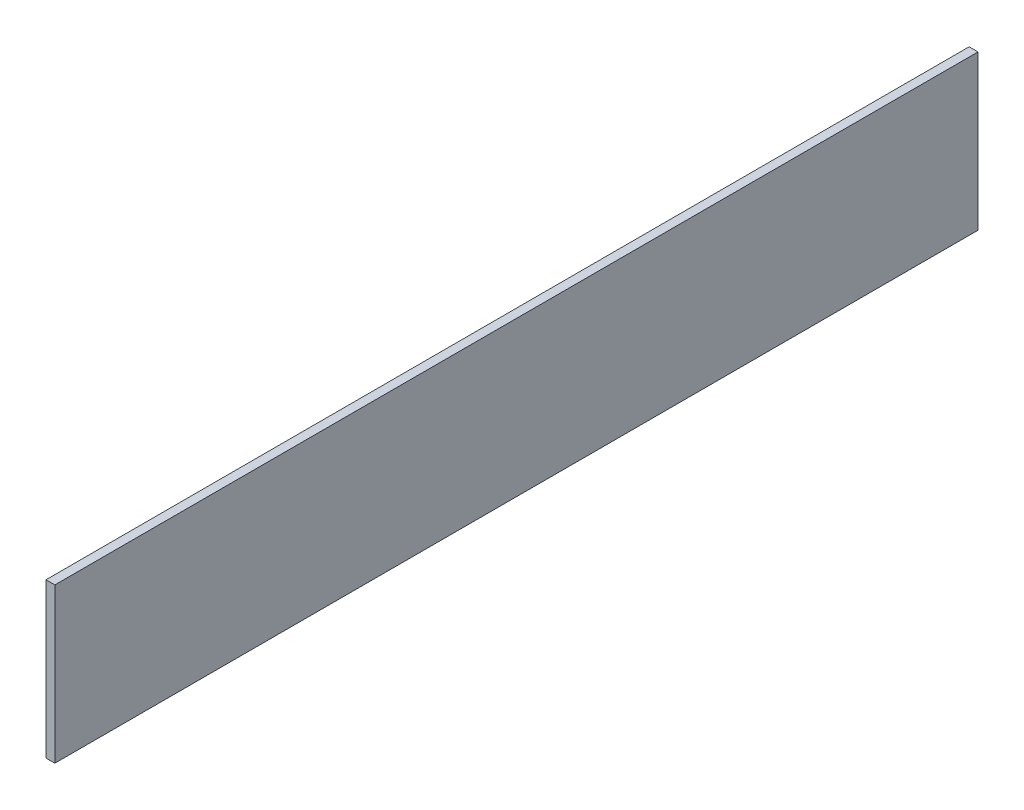
ISO-10303-21;
HEADER;
FILE_DESCRIPTION(('STEP AP214'),'2;1');
FILE_NAME('part.step','',(''),(''),'','','');
FILE_SCHEMA(('AUTOMOTIVE_DESIGN { 1 0 10303 214 1 1 1 1 }'));
ENDSEC;
DATA;
#1=APPLICATION_CONTEXT('core data for automotive mechanical design processes');
#2=APPLICATION_PROTOCOL_DEFINITION('international standard','automotive_design',2000,#1);
#3=PRODUCT_CONTEXT('',#1,'mechanical');
#4=PRODUCT('Part','Part','',(#3));
#5=PRODUCT_RELATED_PRODUCT_CATEGORY('part','',(#4));
#6=PRODUCT_DEFINITION_FORMATION('','',#4);
#7=PRODUCT_DEFINITION_CONTEXT('part definition',#1,'design');
#8=PRODUCT_DEFINITION('design','',#6,#7);
#9=PRODUCT_DEFINITION_SHAPE('','',#8);
#10=(LENGTH_UNIT() NAMED_UNIT(*) SI_UNIT(.MILLI.,.METRE.));
#11=(NAMED_UNIT(*) PLANE_ANGLE_UNIT() SI_UNIT($,.RADIAN.));
#12=(NAMED_UNIT(*) SI_UNIT($,.STERADIAN.) SOLID_ANGLE_UNIT());
#13=UNCERTAINTY_MEASURE_WITH_UNIT(LENGTH_MEASURE(1.E-05),#10,'distance_accuracy_value','');
#14=(GEOMETRIC_REPRESENTATION_CONTEXT(3) GLOBAL_UNCERTAINTY_ASSIGNED_CONTEXT((#13)) GLOBAL_UNIT_ASSIGNED_CONTEXT((#10,
#11,#12)) REPRESENTATION_CONTEXT('',''));
#15=CARTESIAN_POINT('',(0.,0.,0.));
#16=DIRECTION('',(0.,0.,1.));
#17=DIRECTION('',(1.,0.,0.));
#18=AXIS2_PLACEMENT_3D('',#15,#16,#17);
#19=CARTESIAN_POINT('',(2.5,0.,99.9999999999999));
#20=DIRECTION('',(0.,-1.,0.));
#21=DIRECTION('',(0.,0.,-1.));
#22=AXIS2_PLACEMENT_3D('',#19,#20,#21);
#23=PLANE('',#22);
#24=DIRECTION('',(-1.,0.,0.));
#25=VECTOR('',#24,1.);
#26=CARTESIAN_POINT('',(2.5,0.,99.9999999999999));
#27=LINE('',#26,#25);
#28=CARTESIAN_POINT('',(0.,0.,99.9999999999999));
#29=VERTEX_POINT('',#28);
#30=CARTESIAN_POINT('',(-2.5,0.,99.9999999999999));
#31=VERTEX_POINT('',#30);
#32=EDGE_CURVE('E46',#29,#31,#27,.T.);
#33=ORIENTED_EDGE('',*,*,#32,.F.);
#34=DIRECTION('',(0.,0.,-1.));
#35=VECTOR('',#34,1.);
#36=CARTESIAN_POINT('',(0.,0.,99.9999999999999));
#37=LINE('',#36,#35);
#38=CARTESIAN_POINT('',(0.,0.,-100.));
#39=VERTEX_POINT('',#38);
#40=EDGE_CURVE('E138',#29,#39,#37,.T.);
#41=ORIENTED_EDGE('',*,*,#40,.T.);
#42=DIRECTION('',(-1.,0.,0.));
#43=VECTOR('',#42,1.);
#44=CARTESIAN_POINT('',(2.5,0.,-100.));
#45=LINE('',#44,#43);
#46=CARTESIAN_POINT('',(-2.5,0.,-100.));
#47=VERTEX_POINT('',#46);
#48=EDGE_CURVE('E60',#39,#47,#45,.T.);
#49=ORIENTED_EDGE('',*,*,#48,.T.);
#50=DIRECTION('',(0.,0.,1.));
#51=VECTOR('',#50,1.);
#52=CARTESIAN_POINT('',(-2.5,0.,99.9999999999999));
#53=LINE('',#52,#51);
#54=EDGE_CURVE('E140',#47,#31,#53,.T.);
#55=ORIENTED_EDGE('',*,*,#54,.T.);
#56=EDGE_LOOP('',(#33,#41,#49,#55));
#57=FACE_BOUND('',#56,.T.);
#58=ADVANCED_FACE('F39',(#57),#23,.F.);
#59=CARTESIAN_POINT('',(2.5,0.,99.9999999999999));
#60=DIRECTION('',(0.,0.,-1.));
#61=DIRECTION('',(-1.,0.,0.));
#62=AXIS2_PLACEMENT_3D('',#59,#60,#61);
#63=PLANE('',#62);
#64=DIRECTION('',(-1.,0.,0.));
#65=VECTOR('',#64,1.);
#66=CARTESIAN_POINT('',(2.5,-35.,99.9999999999999));
#67=LINE('',#66,#65);
#68=CARTESIAN_POINT('',(0.,-35.,99.9999999999999));
#69=VERTEX_POINT('',#68);
#70=CARTESIAN_POINT('',(-2.5,-35.,99.9999999999999));
#71=VERTEX_POINT('',#70);
#72=EDGE_CURVE('E153',#69,#71,#67,.T.);
#73=ORIENTED_EDGE('',*,*,#72,.F.);
#74=DIRECTION('',(0.,1.,0.));
#75=VECTOR('',#74,1.);
#76=CARTESIAN_POINT('',(0.,0.,99.9999999999999));
#77=LINE('',#76,#75);
#78=EDGE_CURVE('E130',#69,#29,#77,.T.);
#79=ORIENTED_EDGE('',*,*,#78,.T.);
#80=ORIENTED_EDGE('',*,*,#32,.T.);
#81=DIRECTION('',(0.,-1.,0.));
#82=VECTOR('',#81,1.);
#83=CARTESIAN_POINT('',(-2.5,0.,99.9999999999999));
#84=LINE('',#83,#82);
#85=EDGE_CURVE('E142',#31,#71,#84,.T.);
#86=ORIENTED_EDGE('',*,*,#85,.T.);
#87=EDGE_LOOP('',(#73,#79,#80,#86));
#88=FACE_BOUND('',#87,.T.);
#89=ADVANCED_FACE('F158',(#88),#63,.F.);
#90=CARTESIAN_POINT('',(2.5,-35.,99.9999999999999));
#91=DIRECTION('',(0.,1.,0.));
#92=DIRECTION('',(0.,0.,1.));
#93=AXIS2_PLACEMENT_3D('',#90,#91,#92);
#94=PLANE('',#93);
#95=DIRECTION('',(-1.,0.,0.));
#96=VECTOR('',#95,1.);
#97=CARTESIAN_POINT('',(2.5,-35.,-100.));
#98=LINE('',#97,#96);
#99=CARTESIAN_POINT('',(0.,-35.,-100.));
#100=VERTEX_POINT('',#99);
#101=CARTESIAN_POINT('',(-2.5,-35.,-100.));
#102=VERTEX_POINT('',#101);
#103=EDGE_CURVE('E151',#100,#102,#98,.T.);
#104=ORIENTED_EDGE('',*,*,#103,.F.);
#105=DIRECTION('',(0.,0.,1.));
#106=VECTOR('',#105,1.);
#107=CARTESIAN_POINT('',(0.,-35.,99.9999999999999));
#108=LINE('',#107,#106);
#109=EDGE_CURVE('E53',#100,#69,#108,.T.);
#110=ORIENTED_EDGE('',*,*,#109,.T.);
#111=ORIENTED_EDGE('',*,*,#72,.T.);
#112=DIRECTION('',(0.,0.,-1.));
#113=VECTOR('',#112,1.);
#114=CARTESIAN_POINT('',(-2.5,-35.,99.9999999999999));
#115=LINE('',#114,#113);
#116=EDGE_CURVE('E145',#71,#102,#115,.T.);
#117=ORIENTED_EDGE('',*,*,#116,.T.);
#118=EDGE_LOOP('',(#104,#110,#111,#117));
#119=FACE_BOUND('',#118,.T.);
#120=ADVANCED_FACE('F169',(#119),#94,.F.);
#121=CARTESIAN_POINT('',(2.5,0.,-100.));
#122=DIRECTION('',(0.,0.,1.));
#123=DIRECTION('',(1.,0.,0.));
#124=AXIS2_PLACEMENT_3D('',#121,#122,#123);
#125=PLANE('',#124);
#126=ORIENTED_EDGE('',*,*,#48,.F.);
#127=DIRECTION('',(0.,-1.,0.));
#128=VECTOR('',#127,1.);
#129=CARTESIAN_POINT('',(0.,0.,-100.));
#130=LINE('',#129,#128);
#131=EDGE_CURVE('E11',#39,#100,#130,.T.);
#132=ORIENTED_EDGE('',*,*,#131,.T.);
#133=ORIENTED_EDGE('',*,*,#103,.T.);
#134=DIRECTION('',(0.,1.,0.));
#135=VECTOR('',#134,1.);
#136=CARTESIAN_POINT('',(-2.5,0.,-100.));
#137=LINE('',#136,#135);
#138=EDGE_CURVE('E148',#102,#47,#137,.T.);
#139=ORIENTED_EDGE('',*,*,#138,.T.);
#140=EDGE_LOOP('',(#126,#132,#133,#139));
#141=FACE_BOUND('',#140,.T.);
#142=ADVANCED_FACE('F173',(#141),#125,.F.);
#143=CARTESIAN_POINT('',(-2.5,0.,0.));
#144=DIRECTION('',(-1.,0.,0.));
#145=DIRECTION('',(0.,0.,1.));
#146=AXIS2_PLACEMENT_3D('',#143,#144,#145);
#147=PLANE('',#146);
#148=ORIENTED_EDGE('',*,*,#54,.F.);
#149=ORIENTED_EDGE('',*,*,#138,.F.);
#150=ORIENTED_EDGE('',*,*,#116,.F.);
#151=ORIENTED_EDGE('',*,*,#85,.F.);
#152=EDGE_LOOP('',(#148,#149,#150,#151));
#153=FACE_BOUND('',#152,.T.);
#154=ADVANCED_FACE('F162',(#153),#147,.T.);
#155=CARTESIAN_POINT('',(0.,0.,0.));
#156=DIRECTION('',(-1.,0.,0.));
#157=DIRECTION('',(0.,0.,1.));
#158=AXIS2_PLACEMENT_3D('',#155,#156,#157);
#159=PLANE('',#158);
#160=DIRECTION('',(0.,-1.,0.));
#161=VECTOR('',#160,1.);
#162=CARTESIAN_POINT('',(0.,-41.,130.));
#163=LINE('',#162,#161);
#164=CARTESIAN_POINT('',(0.,2.5,130.));
#165=VERTEX_POINT('',#164);
#166=CARTESIAN_POINT('',(0.,-41.,130.));
#167=VERTEX_POINT('',#166);
#168=EDGE_CURVE('E128',#165,#167,#163,.T.);
#169=ORIENTED_EDGE('',*,*,#168,.F.);
#170=DIRECTION('',(0.,0.,1.));
#171=VECTOR('',#170,1.);
#172=CARTESIAN_POINT('',(0.,2.5,130.));
#173=LINE('',#172,#171);
#174=CARTESIAN_POINT('',(0.,2.5,-130.));
#175=VERTEX_POINT('',#174);
#176=EDGE_CURVE('E124',#175,#165,#173,.T.);
#177=ORIENTED_EDGE('',*,*,#176,.F.);
#178=DIRECTION('',(0.,1.,0.));
#179=VECTOR('',#178,1.);
#180=CARTESIAN_POINT('',(0.,-41.,-130.));
#181=LINE('',#180,#179);
#182=CARTESIAN_POINT('',(0.,-41.,-130.));
#183=VERTEX_POINT('',#182);
#184=EDGE_CURVE('E205',#183,#175,#181,.T.);
#185=ORIENTED_EDGE('',*,*,#184,.F.);
#186=DIRECTION('',(0.,0.,-1.));
#187=VECTOR('',#186,1.);
#188=CARTESIAN_POINT('',(0.,-41.,130.));
#189=LINE('',#188,#187);
#190=EDGE_CURVE('E203',#167,#183,#189,.T.);
#191=ORIENTED_EDGE('',*,*,#190,.F.);
#192=EDGE_LOOP('',(#169,#177,#185,#191));
#193=FACE_BOUND('',#192,.T.);
#194=ORIENTED_EDGE('',*,*,#40,.F.);
#195=ORIENTED_EDGE('',*,*,#78,.F.);
#196=ORIENTED_EDGE('',*,*,#109,.F.);
#197=ORIENTED_EDGE('',*,*,#131,.F.);
#198=EDGE_LOOP('',(#194,#195,#196,#197));
#199=FACE_BOUND('',#198,.T.);
#200=ADVANCED_FACE('F181',(#193,#199),#159,.T.);
#201=CARTESIAN_POINT('',(2.49999999999999,-41.,130.));
#202=DIRECTION('',(0.,0.,-1.));
#203=DIRECTION('',(-1.,0.,0.));
#204=AXIS2_PLACEMENT_3D('',#201,#202,#203);
#205=PLANE('',#204);
#206=ORIENTED_EDGE('',*,*,#168,.T.);
#207=DIRECTION('',(-1.,0.,0.));
#208=VECTOR('',#207,1.);
#209=CARTESIAN_POINT('',(2.49999999999999,-41.,130.));
#210=LINE('',#209,#208);
#211=CARTESIAN_POINT('',(2.49999999999999,-41.,130.));
#212=VERTEX_POINT('',#211);
#213=EDGE_CURVE('E108',#212,#167,#210,.T.);
#214=ORIENTED_EDGE('',*,*,#213,.F.);
#215=DIRECTION('',(0.,-1.,0.));
#216=VECTOR('',#215,1.);
#217=CARTESIAN_POINT('',(2.49999999999999,-41.,130.));
#218=LINE('',#217,#216);
#219=CARTESIAN_POINT('',(2.49999999999999,2.5,130.));
#220=VERTEX_POINT('',#219);
#221=EDGE_CURVE('E115',#220,#212,#218,.T.);
#222=ORIENTED_EDGE('',*,*,#221,.F.);
#223=DIRECTION('',(-1.,0.,0.));
#224=VECTOR('',#223,1.);
#225=CARTESIAN_POINT('',(2.49999999999999,2.5,130.));
#226=LINE('',#225,#224);
#227=EDGE_CURVE('E212',#220,#165,#226,.T.);
#228=ORIENTED_EDGE('',*,*,#227,.T.);
#229=EDGE_LOOP('',(#206,#214,#222,#228));
#230=FACE_BOUND('',#229,.T.);
#231=ADVANCED_FACE('F126',(#230),#205,.F.);
#232=CARTESIAN_POINT('',(2.49999999999999,-41.,130.));
#233=DIRECTION('',(0.,1.,0.));
#234=DIRECTION('',(0.,0.,1.));
#235=AXIS2_PLACEMENT_3D('',#232,#233,#234);
#236=PLANE('',#235);
#237=ORIENTED_EDGE('',*,*,#190,.T.);
#238=DIRECTION('',(-1.,0.,0.));
#239=VECTOR('',#238,1.);
#240=CARTESIAN_POINT('',(2.50000000000001,-41.,-130.));
#241=LINE('',#240,#239);
#242=CARTESIAN_POINT('',(2.50000000000001,-41.,-130.));
#243=VERTEX_POINT('',#242);
#244=EDGE_CURVE('E111',#243,#183,#241,.T.);
#245=ORIENTED_EDGE('',*,*,#244,.F.);
#246=DIRECTION('',(0.,0.,-1.));
#247=VECTOR('',#246,1.);
#248=CARTESIAN_POINT('',(2.49999999999999,-41.,130.));
#249=LINE('',#248,#247);
#250=EDGE_CURVE('E104',#212,#243,#249,.T.);
#251=ORIENTED_EDGE('',*,*,#250,.F.);
#252=ORIENTED_EDGE('',*,*,#213,.T.);
#253=EDGE_LOOP('',(#237,#245,#251,#252));
#254=FACE_BOUND('',#253,.T.);
#255=ADVANCED_FACE('F106',(#254),#236,.F.);
#256=CARTESIAN_POINT('',(2.50000000000001,-41.,-130.));
#257=DIRECTION('',(0.,0.,1.));
#258=DIRECTION('',(1.,0.,0.));
#259=AXIS2_PLACEMENT_3D('',#256,#257,#258);
#260=PLANE('',#259);
#261=ORIENTED_EDGE('',*,*,#184,.T.);
#262=DIRECTION('',(-1.,0.,0.));
#263=VECTOR('',#262,1.);
#264=CARTESIAN_POINT('',(2.50000000000001,2.5,-130.));
#265=LINE('',#264,#263);
#266=CARTESIAN_POINT('',(2.50000000000001,2.5,-130.));
#267=VERTEX_POINT('',#266);
#268=EDGE_CURVE('E132',#267,#175,#265,.T.);
#269=ORIENTED_EDGE('',*,*,#268,.F.);
#270=DIRECTION('',(0.,1.,0.));
#271=VECTOR('',#270,1.);
#272=CARTESIAN_POINT('',(2.50000000000001,-41.,-130.));
#273=LINE('',#272,#271);
#274=EDGE_CURVE('E114',#243,#267,#273,.T.);
#275=ORIENTED_EDGE('',*,*,#274,.F.);
#276=ORIENTED_EDGE('',*,*,#244,.T.);
#277=EDGE_LOOP('',(#261,#269,#275,#276));
#278=FACE_BOUND('',#277,.T.);
#279=ADVANCED_FACE('F189',(#278),#260,.F.);
#280=CARTESIAN_POINT('',(2.49999999999999,2.5,130.));
#281=DIRECTION('',(0.,-1.,0.));
#282=DIRECTION('',(0.,0.,-1.));
#283=AXIS2_PLACEMENT_3D('',#280,#281,#282);
#284=PLANE('',#283);
#285=ORIENTED_EDGE('',*,*,#176,.T.);
#286=ORIENTED_EDGE('',*,*,#227,.F.);
#287=DIRECTION('',(0.,0.,1.));
#288=VECTOR('',#287,1.);
#289=CARTESIAN_POINT('',(2.49999999999999,2.5,130.));
#290=LINE('',#289,#288);
#291=EDGE_CURVE('E120',#267,#220,#290,.T.);
#292=ORIENTED_EDGE('',*,*,#291,.F.);
#293=ORIENTED_EDGE('',*,*,#268,.T.);
#294=EDGE_LOOP('',(#285,#286,#292,#293));
#295=FACE_BOUND('',#294,.T.);
#296=ADVANCED_FACE('F184',(#295),#284,.F.);
#297=CARTESIAN_POINT('',(2.5,0.,0.));
#298=DIRECTION('',(-1.,0.,0.));
#299=DIRECTION('',(0.,0.,1.));
#300=AXIS2_PLACEMENT_3D('',#297,#298,#299);
#301=PLANE('',#300);
#302=ORIENTED_EDGE('',*,*,#221,.T.);
#303=ORIENTED_EDGE('',*,*,#250,.T.);
#304=ORIENTED_EDGE('',*,*,#274,.T.);
#305=ORIENTED_EDGE('',*,*,#291,.T.);
#306=EDGE_LOOP('',(#302,#303,#304,#305));
#307=FACE_BOUND('',#306,.T.);
#308=ADVANCED_FACE('F118',(#307),#301,.F.);
#309=CLOSED_SHELL('',(#58,#89,#120,#142,#154,#200,#231,#255,#279,#296,#308));
#310=MANIFOLD_SOLID_BREP('B2',#309);
#311=ADVANCED_BREP_SHAPE_REPRESENTATION('',(#18,#310),#14);
#312=SHAPE_DEFINITION_REPRESENTATION(#9,#311);
ENDSEC;
END-ISO-10303-21;
